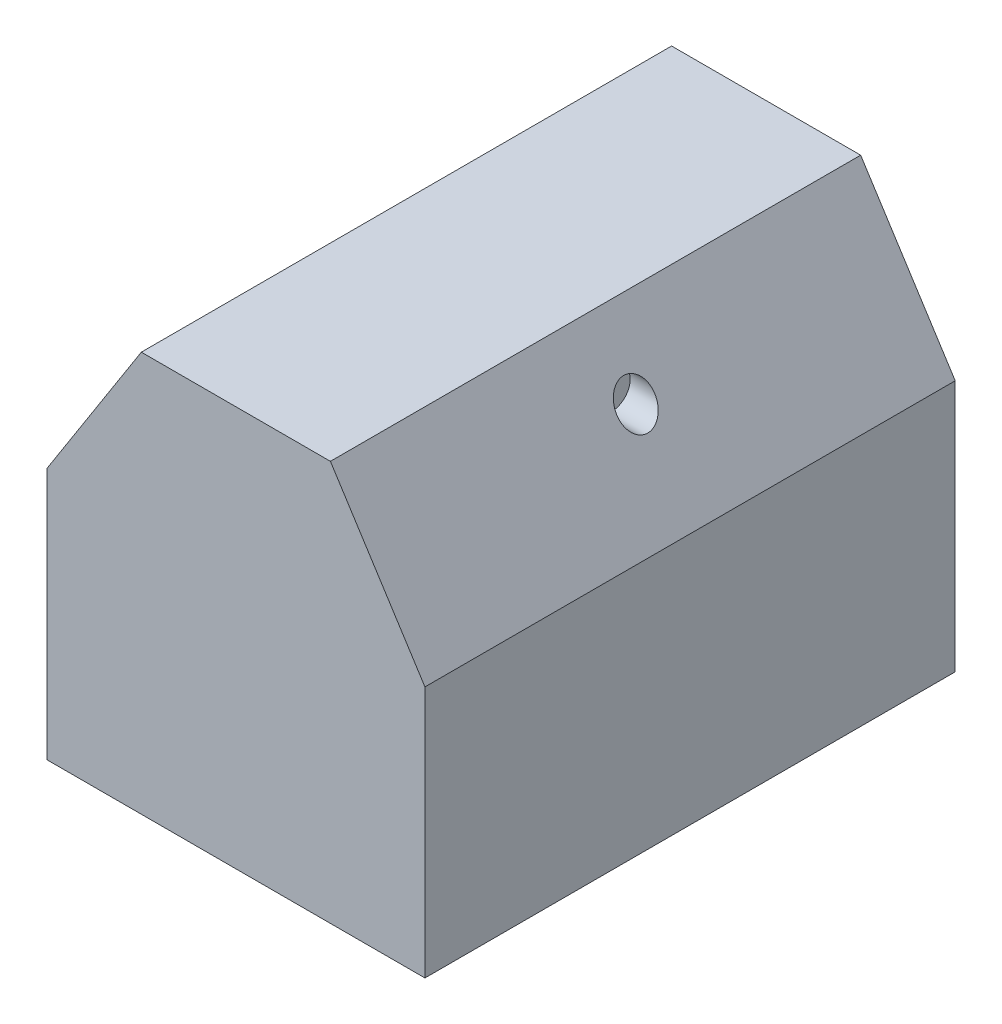
ISO-10303-21;
HEADER;
FILE_DESCRIPTION(('STEP AP214'),'2;1');
FILE_NAME('part.step','',(''),(''),'','','');
FILE_SCHEMA(('AUTOMOTIVE_DESIGN { 1 0 10303 214 1 1 1 1 }'));
ENDSEC;
DATA;
#1=APPLICATION_CONTEXT('core data for automotive mechanical design processes');
#2=APPLICATION_PROTOCOL_DEFINITION('international standard','automotive_design',2000,#1);
#3=PRODUCT_CONTEXT('',#1,'mechanical');
#4=PRODUCT('Part','Part','',(#3));
#5=PRODUCT_RELATED_PRODUCT_CATEGORY('part','',(#4));
#6=PRODUCT_DEFINITION_FORMATION('','',#4);
#7=PRODUCT_DEFINITION_CONTEXT('part definition',#1,'design');
#8=PRODUCT_DEFINITION('design','',#6,#7);
#9=PRODUCT_DEFINITION_SHAPE('','',#8);
#10=(LENGTH_UNIT() NAMED_UNIT(*) SI_UNIT(.MILLI.,.METRE.));
#11=(NAMED_UNIT(*) PLANE_ANGLE_UNIT() SI_UNIT($,.RADIAN.));
#12=(NAMED_UNIT(*) SI_UNIT($,.STERADIAN.) SOLID_ANGLE_UNIT());
#13=UNCERTAINTY_MEASURE_WITH_UNIT(LENGTH_MEASURE(1.E-05),#10,'distance_accuracy_value','');
#14=(GEOMETRIC_REPRESENTATION_CONTEXT(3) GLOBAL_UNCERTAINTY_ASSIGNED_CONTEXT((#13)) GLOBAL_UNIT_ASSIGNED_CONTEXT((#10,
#11,#12)) REPRESENTATION_CONTEXT('',''));
#15=CARTESIAN_POINT('',(0.,0.,0.));
#16=DIRECTION('',(0.,0.,1.));
#17=DIRECTION('',(1.,0.,0.));
#18=AXIS2_PLACEMENT_3D('',#15,#16,#17);
#19=CARTESIAN_POINT('',(60.,0.,84.1375));
#20=DIRECTION('',(-1.,0.,0.));
#21=DIRECTION('',(0.,0.,1.));
#22=AXIS2_PLACEMENT_3D('',#19,#20,#21);
#23=PLANE('',#22);
#24=DIRECTION('',(0.,1.,0.));
#25=VECTOR('',#24,1.);
#26=CARTESIAN_POINT('',(60.,0.,-84.1375));
#27=LINE('',#26,#25);
#28=CARTESIAN_POINT('',(60.,0.,-84.1375));
#29=VERTEX_POINT('',#28);
#30=CARTESIAN_POINT('',(60.,80.,-84.1375));
#31=VERTEX_POINT('',#30);
#32=EDGE_CURVE('E121',#29,#31,#27,.T.);
#33=ORIENTED_EDGE('',*,*,#32,.T.);
#34=DIRECTION('',(0.,0.,-1.));
#35=VECTOR('',#34,1.);
#36=CARTESIAN_POINT('',(60.,80.,84.1375));
#37=LINE('',#36,#35);
#38=CARTESIAN_POINT('',(60.,80.,84.1375));
#39=VERTEX_POINT('',#38);
#40=EDGE_CURVE('E11',#39,#31,#37,.T.);
#41=ORIENTED_EDGE('',*,*,#40,.F.);
#42=DIRECTION('',(0.,1.,0.));
#43=VECTOR('',#42,1.);
#44=CARTESIAN_POINT('',(60.,0.,84.1375));
#45=LINE('',#44,#43);
#46=CARTESIAN_POINT('',(60.,0.,84.1375));
#47=VERTEX_POINT('',#46);
#48=EDGE_CURVE('E132',#47,#39,#45,.T.);
#49=ORIENTED_EDGE('',*,*,#48,.F.);
#50=DIRECTION('',(0.,0.,-1.));
#51=VECTOR('',#50,1.);
#52=CARTESIAN_POINT('',(60.,0.,84.1375));
#53=LINE('',#52,#51);
#54=EDGE_CURVE('E117',#47,#29,#53,.T.);
#55=ORIENTED_EDGE('',*,*,#54,.T.);
#56=EDGE_LOOP('',(#33,#41,#49,#55));
#57=FACE_BOUND('',#56,.T.);
#58=ADVANCED_FACE('F35',(#57),#23,.F.);
#59=CARTESIAN_POINT('',(60.,80.,84.1375));
#60=DIRECTION('',(-0.842922209577588,-0.538035452921865,0.));
#61=DIRECTION('',(0.538035452921865,-0.842922209577588,0.));
#62=AXIS2_PLACEMENT_3D('',#59,#60,#61);
#63=PLANE('',#62);
#64=CARTESIAN_POINT('',(42.7659574468085,107.,0.));
#65=DIRECTION('',(-0.842922209577588,-0.538035452921865,0.));
#66=DIRECTION('',(-0.538035452921865,0.842922209577588,0.));
#67=AXIS2_PLACEMENT_3D('',#64,#65,#66);
#68=ELLIPSE('',#67,7.118094566528,6.00000000000001);
#69=CARTESIAN_POINT('',(38.936170212766,113.,0.));
#70=VERTEX_POINT('',#69);
#71=EDGE_CURVE('E38',#70,#70,#68,.F.);
#72=ORIENTED_EDGE('',*,*,#71,.F.);
#73=EDGE_LOOP('',(#72));
#74=FACE_BOUND('',#73,.T.);
#75=DIRECTION('',(-0.538035452921865,0.842922209577588,0.));
#76=VECTOR('',#75,1.);
#77=CARTESIAN_POINT('',(60.,80.,-84.1375));
#78=LINE('',#77,#76);
#79=CARTESIAN_POINT('',(30.,127.,-84.1375));
#80=VERTEX_POINT('',#79);
#81=EDGE_CURVE('E124',#31,#80,#78,.T.);
#82=ORIENTED_EDGE('',*,*,#81,.T.);
#83=DIRECTION('',(0.,0.,-1.));
#84=VECTOR('',#83,1.);
#85=CARTESIAN_POINT('',(30.,127.,84.1375));
#86=LINE('',#85,#84);
#87=CARTESIAN_POINT('',(30.,127.,84.1375));
#88=VERTEX_POINT('',#87);
#89=EDGE_CURVE('E44',#88,#80,#86,.T.);
#90=ORIENTED_EDGE('',*,*,#89,.F.);
#91=DIRECTION('',(-0.538035452921865,0.842922209577588,0.));
#92=VECTOR('',#91,1.);
#93=CARTESIAN_POINT('',(60.,80.,84.1375));
#94=LINE('',#93,#92);
#95=EDGE_CURVE('E90',#39,#88,#94,.T.);
#96=ORIENTED_EDGE('',*,*,#95,.F.);
#97=ORIENTED_EDGE('',*,*,#40,.T.);
#98=EDGE_LOOP('',(#82,#90,#96,#97));
#99=FACE_BOUND('',#98,.T.);
#100=ADVANCED_FACE('F152',(#74,#99),#63,.F.);
#101=CARTESIAN_POINT('',(30.,127.,84.1375));
#102=DIRECTION('',(0.,-1.,0.));
#103=DIRECTION('',(0.,0.,-1.));
#104=AXIS2_PLACEMENT_3D('',#101,#102,#103);
#105=PLANE('',#104);
#106=DIRECTION('',(-1.,0.,0.));
#107=VECTOR('',#106,1.);
#108=CARTESIAN_POINT('',(30.,127.,-84.1375));
#109=LINE('',#108,#107);
#110=CARTESIAN_POINT('',(-30.,127.,-84.1375));
#111=VERTEX_POINT('',#110);
#112=EDGE_CURVE('E127',#80,#111,#109,.T.);
#113=ORIENTED_EDGE('',*,*,#112,.T.);
#114=DIRECTION('',(0.,0.,-1.));
#115=VECTOR('',#114,1.);
#116=CARTESIAN_POINT('',(-30.,127.,84.1375));
#117=LINE('',#116,#115);
#118=CARTESIAN_POINT('',(-30.,127.,84.1375));
#119=VERTEX_POINT('',#118);
#120=EDGE_CURVE('E112',#119,#111,#117,.T.);
#121=ORIENTED_EDGE('',*,*,#120,.F.);
#122=DIRECTION('',(-1.,0.,0.));
#123=VECTOR('',#122,1.);
#124=CARTESIAN_POINT('',(30.,127.,84.1375));
#125=LINE('',#124,#123);
#126=EDGE_CURVE('E103',#88,#119,#125,.T.);
#127=ORIENTED_EDGE('',*,*,#126,.F.);
#128=ORIENTED_EDGE('',*,*,#89,.T.);
#129=EDGE_LOOP('',(#113,#121,#127,#128));
#130=FACE_BOUND('',#129,.T.);
#131=ADVANCED_FACE('F155',(#130),#105,.F.);
#132=CARTESIAN_POINT('',(-60.,80.,84.1375));
#133=DIRECTION('',(0.842922209577588,-0.538035452921865,0.));
#134=DIRECTION('',(0.538035452921865,0.842922209577588,0.));
#135=AXIS2_PLACEMENT_3D('',#132,#133,#134);
#136=PLANE('',#135);
#137=CARTESIAN_POINT('',(-42.7659574468085,107.,0.));
#138=DIRECTION('',(0.842922209577588,-0.538035452921865,0.));
#139=DIRECTION('',(0.538035452921865,0.842922209577588,0.));
#140=AXIS2_PLACEMENT_3D('',#137,#138,#139);
#141=ELLIPSE('',#140,7.118094566528,6.00000000000001);
#142=CARTESIAN_POINT('',(-38.936170212766,113.,0.));
#143=VERTEX_POINT('',#142);
#144=EDGE_CURVE('E125',#143,#143,#141,.T.);
#145=ORIENTED_EDGE('',*,*,#144,.T.);
#146=EDGE_LOOP('',(#145));
#147=FACE_BOUND('',#146,.T.);
#148=DIRECTION('',(-0.538035452921865,-0.842922209577588,0.));
#149=VECTOR('',#148,1.);
#150=CARTESIAN_POINT('',(-60.,80.,-84.1375));
#151=LINE('',#150,#149);
#152=CARTESIAN_POINT('',(-60.,80.,-84.1375));
#153=VERTEX_POINT('',#152);
#154=EDGE_CURVE('E111',#111,#153,#151,.T.);
#155=ORIENTED_EDGE('',*,*,#154,.T.);
#156=DIRECTION('',(0.,0.,-1.));
#157=VECTOR('',#156,1.);
#158=CARTESIAN_POINT('',(-60.,80.,84.1375));
#159=LINE('',#158,#157);
#160=CARTESIAN_POINT('',(-60.,80.,84.1375));
#161=VERTEX_POINT('',#160);
#162=EDGE_CURVE('E108',#161,#153,#159,.T.);
#163=ORIENTED_EDGE('',*,*,#162,.F.);
#164=DIRECTION('',(-0.538035452921865,-0.842922209577588,0.));
#165=VECTOR('',#164,1.);
#166=CARTESIAN_POINT('',(-60.,80.,84.1375));
#167=LINE('',#166,#165);
#168=EDGE_CURVE('E97',#119,#161,#167,.T.);
#169=ORIENTED_EDGE('',*,*,#168,.F.);
#170=ORIENTED_EDGE('',*,*,#120,.T.);
#171=EDGE_LOOP('',(#155,#163,#169,#170));
#172=FACE_BOUND('',#171,.T.);
#173=ADVANCED_FACE('F109',(#147,#172),#136,.F.);
#174=CARTESIAN_POINT('',(-60.,0.,84.1375));
#175=DIRECTION('',(1.,0.,0.));
#176=DIRECTION('',(0.,0.,-1.));
#177=AXIS2_PLACEMENT_3D('',#174,#175,#176);
#178=PLANE('',#177);
#179=DIRECTION('',(0.,-1.,0.));
#180=VECTOR('',#179,1.);
#181=CARTESIAN_POINT('',(-60.,0.,-84.1375));
#182=LINE('',#181,#180);
#183=CARTESIAN_POINT('',(-60.,0.,-84.1375));
#184=VERTEX_POINT('',#183);
#185=EDGE_CURVE('E76',#153,#184,#182,.T.);
#186=ORIENTED_EDGE('',*,*,#185,.T.);
#187=DIRECTION('',(0.,0.,-1.));
#188=VECTOR('',#187,1.);
#189=CARTESIAN_POINT('',(-60.,0.,84.1375));
#190=LINE('',#189,#188);
#191=CARTESIAN_POINT('',(-60.,0.,84.1375));
#192=VERTEX_POINT('',#191);
#193=EDGE_CURVE('E113',#192,#184,#190,.T.);
#194=ORIENTED_EDGE('',*,*,#193,.F.);
#195=DIRECTION('',(0.,-1.,0.));
#196=VECTOR('',#195,1.);
#197=CARTESIAN_POINT('',(-60.,0.,84.1375));
#198=LINE('',#197,#196);
#199=EDGE_CURVE('E101',#161,#192,#198,.T.);
#200=ORIENTED_EDGE('',*,*,#199,.F.);
#201=ORIENTED_EDGE('',*,*,#162,.T.);
#202=EDGE_LOOP('',(#186,#194,#200,#201));
#203=FACE_BOUND('',#202,.T.);
#204=ADVANCED_FACE('F115',(#203),#178,.F.);
#205=CARTESIAN_POINT('',(-60.,0.,84.1375));
#206=DIRECTION('',(0.,1.,0.));
#207=DIRECTION('',(0.,0.,1.));
#208=AXIS2_PLACEMENT_3D('',#205,#206,#207);
#209=PLANE('',#208);
#210=DIRECTION('',(1.,0.,0.));
#211=VECTOR('',#210,1.);
#212=CARTESIAN_POINT('',(-60.,0.,-84.1375));
#213=LINE('',#212,#211);
#214=EDGE_CURVE('E82',#184,#29,#213,.T.);
#215=ORIENTED_EDGE('',*,*,#214,.T.);
#216=ORIENTED_EDGE('',*,*,#54,.F.);
#217=DIRECTION('',(1.,0.,0.));
#218=VECTOR('',#217,1.);
#219=CARTESIAN_POINT('',(-60.,0.,84.1375));
#220=LINE('',#219,#218);
#221=EDGE_CURVE('E53',#192,#47,#220,.T.);
#222=ORIENTED_EDGE('',*,*,#221,.F.);
#223=ORIENTED_EDGE('',*,*,#193,.T.);
#224=EDGE_LOOP('',(#215,#216,#222,#223));
#225=FACE_BOUND('',#224,.T.);
#226=ADVANCED_FACE('F160',(#225),#209,.F.);
#227=CARTESIAN_POINT('',(0.,0.,84.1375));
#228=DIRECTION('',(0.,0.,1.));
#229=DIRECTION('',(1.,0.,0.));
#230=AXIS2_PLACEMENT_3D('',#227,#228,#229);
#231=PLANE('',#230);
#232=ORIENTED_EDGE('',*,*,#48,.T.);
#233=ORIENTED_EDGE('',*,*,#95,.T.);
#234=ORIENTED_EDGE('',*,*,#126,.T.);
#235=ORIENTED_EDGE('',*,*,#168,.T.);
#236=ORIENTED_EDGE('',*,*,#199,.T.);
#237=ORIENTED_EDGE('',*,*,#221,.T.);
#238=EDGE_LOOP('',(#232,#233,#234,#235,#236,#237));
#239=FACE_BOUND('',#238,.T.);
#240=ADVANCED_FACE('F99',(#239),#231,.T.);
#241=CARTESIAN_POINT('',(0.,0.,-84.1375));
#242=DIRECTION('',(0.,0.,1.));
#243=DIRECTION('',(1.,0.,0.));
#244=AXIS2_PLACEMENT_3D('',#241,#242,#243);
#245=PLANE('',#244);
#246=ORIENTED_EDGE('',*,*,#32,.F.);
#247=ORIENTED_EDGE('',*,*,#214,.F.);
#248=ORIENTED_EDGE('',*,*,#185,.F.);
#249=ORIENTED_EDGE('',*,*,#154,.F.);
#250=ORIENTED_EDGE('',*,*,#112,.F.);
#251=ORIENTED_EDGE('',*,*,#81,.F.);
#252=EDGE_LOOP('',(#246,#247,#248,#249,#250,#251));
#253=FACE_BOUND('',#252,.T.);
#254=ADVANCED_FACE('F158',(#253),#245,.F.);
#255=CARTESIAN_POINT('',(-60.,107.,0.));
#256=DIRECTION('',(1.,0.,0.));
#257=DIRECTION('',(0.,0.,-1.));
#258=AXIS2_PLACEMENT_3D('',#255,#256,#257);
#259=CYLINDRICAL_SURFACE('',#258,6.00000000000001);
#260=CARTESIAN_POINT('',(-35.,107.,0.));
#261=DIRECTION('',(1.,0.,0.));
#262=DIRECTION('',(0.,0.,-1.));
#263=AXIS2_PLACEMENT_3D('',#260,#261,#262);
#264=CIRCLE('',#263,6.00000000000001);
#265=CARTESIAN_POINT('',(-35.,107.,-6.00000000000001));
#266=VERTEX_POINT('',#265);
#267=EDGE_CURVE('E138',#266,#266,#264,.T.);
#268=ORIENTED_EDGE('',*,*,#267,.T.);
#269=EDGE_LOOP('',(#268));
#270=FACE_BOUND('',#269,.T.);
#271=ORIENTED_EDGE('',*,*,#144,.F.);
#272=EDGE_LOOP('',(#271));
#273=FACE_BOUND('',#272,.T.);
#274=ADVANCED_FACE('F211',(#270,#273),#259,.F.);
#275=CARTESIAN_POINT('',(-35.,107.,0.));
#276=DIRECTION('',(1.,0.,0.));
#277=DIRECTION('',(0.,0.,-1.));
#278=AXIS2_PLACEMENT_3D('',#275,#276,#277);
#279=PLANE('',#278);
#280=ORIENTED_EDGE('',*,*,#267,.F.);
#281=EDGE_LOOP('',(#280));
#282=FACE_BOUND('',#281,.T.);
#283=ADVANCED_FACE('F219',(#282),#279,.F.);
#284=CARTESIAN_POINT('',(60.,107.,0.));
#285=DIRECTION('',(-1.,0.,0.));
#286=DIRECTION('',(0.,0.,1.));
#287=AXIS2_PLACEMENT_3D('',#284,#285,#286);
#288=CYLINDRICAL_SURFACE('',#287,6.00000000000001);
#289=CARTESIAN_POINT('',(35.,107.,0.));
#290=DIRECTION('',(1.,0.,0.));
#291=DIRECTION('',(0.,0.,-1.));
#292=AXIS2_PLACEMENT_3D('',#289,#290,#291);
#293=CIRCLE('',#292,6.00000000000001);
#294=CARTESIAN_POINT('',(35.,107.,-6.00000000000001));
#295=VERTEX_POINT('',#294);
#296=EDGE_CURVE('E146',#295,#295,#293,.T.);
#297=ORIENTED_EDGE('',*,*,#296,.F.);
#298=EDGE_LOOP('',(#297));
#299=FACE_BOUND('',#298,.T.);
#300=ORIENTED_EDGE('',*,*,#71,.T.);
#301=EDGE_LOOP('',(#300));
#302=FACE_BOUND('',#301,.T.);
#303=ADVANCED_FACE('F225',(#299,#302),#288,.F.);
#304=CARTESIAN_POINT('',(35.,107.,0.));
#305=DIRECTION('',(-1.,0.,0.));
#306=DIRECTION('',(0.,0.,-1.));
#307=AXIS2_PLACEMENT_3D('',#304,#305,#306);
#308=PLANE('',#307);
#309=ORIENTED_EDGE('',*,*,#296,.T.);
#310=EDGE_LOOP('',(#309));
#311=FACE_BOUND('',#310,.T.);
#312=ADVANCED_FACE('F233',(#311),#308,.F.);
#313=CLOSED_SHELL('',(#58,#100,#131,#173,#204,#226,#240,#254,#274,#283,#303,#312));
#314=MANIFOLD_SOLID_BREP('B2',#313);
#315=ADVANCED_BREP_SHAPE_REPRESENTATION('',(#18,#314),#14);
#316=SHAPE_DEFINITION_REPRESENTATION(#9,#315);
ENDSEC;
END-ISO-10303-21;
